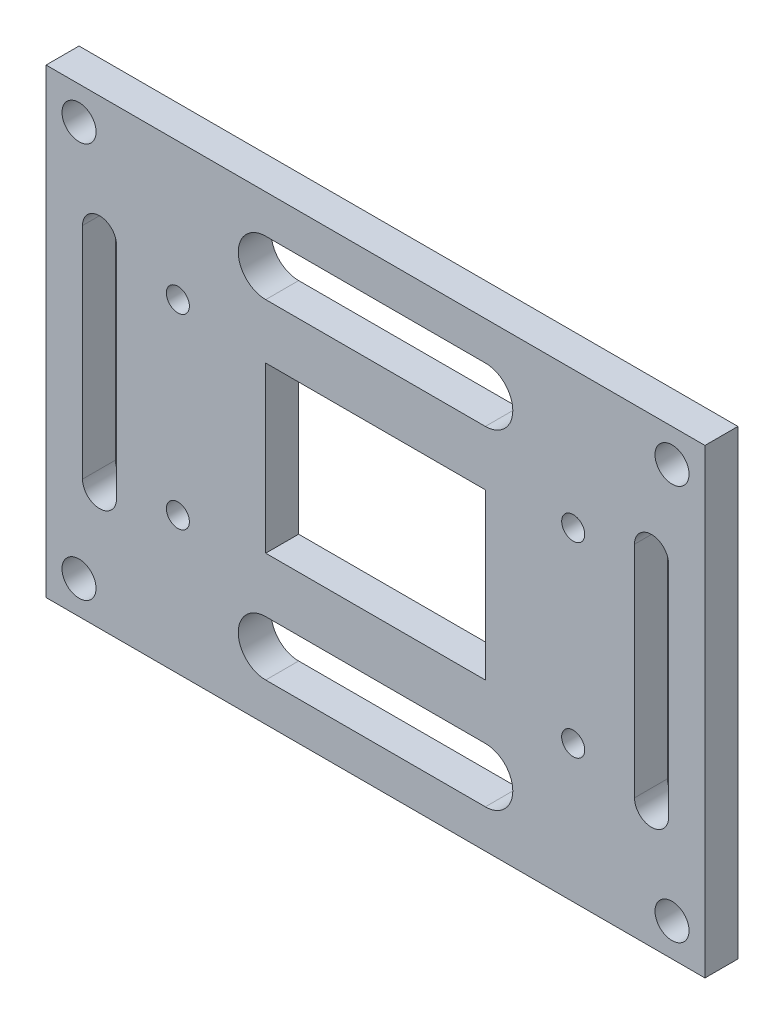
ISO-10303-21;
HEADER;
FILE_DESCRIPTION(('STEP AP214'),'2;1');
FILE_NAME('part.step','',(''),(''),'','','');
FILE_SCHEMA(('AUTOMOTIVE_DESIGN { 1 0 10303 214 1 1 1 1 }'));
ENDSEC;
DATA;
#1=APPLICATION_CONTEXT('core data for automotive mechanical design processes');
#2=APPLICATION_PROTOCOL_DEFINITION('international standard','automotive_design',2000,#1);
#3=PRODUCT_CONTEXT('',#1,'mechanical');
#4=PRODUCT('Part','Part','',(#3));
#5=PRODUCT_RELATED_PRODUCT_CATEGORY('part','',(#4));
#6=PRODUCT_DEFINITION_FORMATION('','',#4);
#7=PRODUCT_DEFINITION_CONTEXT('part definition',#1,'design');
#8=PRODUCT_DEFINITION('design','',#6,#7);
#9=PRODUCT_DEFINITION_SHAPE('','',#8);
#10=(LENGTH_UNIT() NAMED_UNIT(*) SI_UNIT(.MILLI.,.METRE.));
#11=(NAMED_UNIT(*) PLANE_ANGLE_UNIT() SI_UNIT($,.RADIAN.));
#12=(NAMED_UNIT(*) SI_UNIT($,.STERADIAN.) SOLID_ANGLE_UNIT());
#13=UNCERTAINTY_MEASURE_WITH_UNIT(LENGTH_MEASURE(1.E-05),#10,'distance_accuracy_value','');
#14=(GEOMETRIC_REPRESENTATION_CONTEXT(3) GLOBAL_UNCERTAINTY_ASSIGNED_CONTEXT((#13)) GLOBAL_UNIT_ASSIGNED_CONTEXT((#10,
#11,#12)) REPRESENTATION_CONTEXT('',''));
#15=CARTESIAN_POINT('',(0.,0.,0.));
#16=DIRECTION('',(0.,0.,1.));
#17=DIRECTION('',(1.,0.,0.));
#18=AXIS2_PLACEMENT_3D('',#15,#16,#17);
#19=CARTESIAN_POINT('',(0.,0.,3.));
#20=DIRECTION('',(0.,0.,1.));
#21=DIRECTION('',(1.,0.,0.));
#22=AXIS2_PLACEMENT_3D('',#19,#20,#21);
#23=PLANE('',#22);
#24=CARTESIAN_POINT('',(27.,18.,3.));
#25=DIRECTION('',(0.,0.,1.));
#26=DIRECTION('',(1.,0.,0.));
#27=AXIS2_PLACEMENT_3D('',#24,#25,#26);
#28=CIRCLE('',#27,1.55);
#29=CARTESIAN_POINT('',(28.55,18.,3.));
#30=VERTEX_POINT('',#29);
#31=EDGE_CURVE('E333',#30,#30,#28,.T.);
#32=ORIENTED_EDGE('',*,*,#31,.F.);
#33=EDGE_LOOP('',(#32));
#34=FACE_BOUND('',#33,.T.);
#35=CARTESIAN_POINT('',(-27.,-18.,3.));
#36=DIRECTION('',(0.,0.,1.));
#37=DIRECTION('',(1.,0.,0.));
#38=AXIS2_PLACEMENT_3D('',#35,#36,#37);
#39=CIRCLE('',#38,1.55);
#40=CARTESIAN_POINT('',(-25.45,-18.,3.));
#41=VERTEX_POINT('',#40);
#42=EDGE_CURVE('E345',#41,#41,#39,.T.);
#43=ORIENTED_EDGE('',*,*,#42,.F.);
#44=EDGE_LOOP('',(#43));
#45=FACE_BOUND('',#44,.T.);
#46=CARTESIAN_POINT('',(18.,8.5,3.));
#47=DIRECTION('',(0.,0.,1.));
#48=DIRECTION('',(1.,0.,0.));
#49=AXIS2_PLACEMENT_3D('',#46,#47,#48);
#50=CIRCLE('',#49,1.05);
#51=CARTESIAN_POINT('',(19.05,8.5,3.));
#52=VERTEX_POINT('',#51);
#53=EDGE_CURVE('E357',#52,#52,#50,.T.);
#54=ORIENTED_EDGE('',*,*,#53,.F.);
#55=EDGE_LOOP('',(#54));
#56=FACE_BOUND('',#55,.T.);
#57=CARTESIAN_POINT('',(-18.,-8.5,3.));
#58=DIRECTION('',(0.,0.,1.));
#59=DIRECTION('',(1.,0.,0.));
#60=AXIS2_PLACEMENT_3D('',#57,#58,#59);
#61=CIRCLE('',#60,1.05);
#62=CARTESIAN_POINT('',(-16.95,-8.5,3.));
#63=VERTEX_POINT('',#62);
#64=EDGE_CURVE('E369',#63,#63,#61,.T.);
#65=ORIENTED_EDGE('',*,*,#64,.F.);
#66=EDGE_LOOP('',(#65));
#67=FACE_BOUND('',#66,.T.);
#68=DIRECTION('',(0.,1.,0.));
#69=VECTOR('',#68,1.);
#70=CARTESIAN_POINT('',(30.,21.,3.));
#71=LINE('',#70,#69);
#72=CARTESIAN_POINT('',(30.,-21.,3.));
#73=VERTEX_POINT('',#72);
#74=CARTESIAN_POINT('',(30.,21.,3.));
#75=VERTEX_POINT('',#74);
#76=EDGE_CURVE('E406',#73,#75,#71,.T.);
#77=ORIENTED_EDGE('',*,*,#76,.T.);
#78=DIRECTION('',(-1.,0.,0.));
#79=VECTOR('',#78,1.);
#80=CARTESIAN_POINT('',(-30.,21.,3.));
#81=LINE('',#80,#79);
#82=CARTESIAN_POINT('',(-30.,21.,3.));
#83=VERTEX_POINT('',#82);
#84=EDGE_CURVE('E409',#75,#83,#81,.T.);
#85=ORIENTED_EDGE('',*,*,#84,.T.);
#86=DIRECTION('',(0.,-1.,0.));
#87=VECTOR('',#86,1.);
#88=CARTESIAN_POINT('',(-30.,21.,3.));
#89=LINE('',#88,#87);
#90=CARTESIAN_POINT('',(-30.,-21.,3.));
#91=VERTEX_POINT('',#90);
#92=EDGE_CURVE('E412',#83,#91,#89,.T.);
#93=ORIENTED_EDGE('',*,*,#92,.T.);
#94=DIRECTION('',(1.,0.,0.));
#95=VECTOR('',#94,1.);
#96=CARTESIAN_POINT('',(-30.,-21.,3.));
#97=LINE('',#96,#95);
#98=EDGE_CURVE('E414',#91,#73,#97,.T.);
#99=ORIENTED_EDGE('',*,*,#98,.T.);
#100=EDGE_LOOP('',(#77,#85,#93,#99));
#101=FACE_BOUND('',#100,.T.);
#102=DIRECTION('',(-1.,0.,0.));
#103=VECTOR('',#102,1.);
#104=CARTESIAN_POINT('',(-10.,7.5,3.));
#105=LINE('',#104,#103);
#106=CARTESIAN_POINT('',(10.,7.5,3.));
#107=VERTEX_POINT('',#106);
#108=CARTESIAN_POINT('',(-10.,7.5,3.));
#109=VERTEX_POINT('',#108);
#110=EDGE_CURVE('E377',#107,#109,#105,.T.);
#111=ORIENTED_EDGE('',*,*,#110,.F.);
#112=DIRECTION('',(0.,1.,0.));
#113=VECTOR('',#112,1.);
#114=CARTESIAN_POINT('',(10.,7.5,3.));
#115=LINE('',#114,#113);
#116=CARTESIAN_POINT('',(10.,-7.5,3.));
#117=VERTEX_POINT('',#116);
#118=EDGE_CURVE('E375',#117,#107,#115,.T.);
#119=ORIENTED_EDGE('',*,*,#118,.F.);
#120=DIRECTION('',(1.,0.,0.));
#121=VECTOR('',#120,1.);
#122=CARTESIAN_POINT('',(-10.,-7.5,3.));
#123=LINE('',#122,#121);
#124=CARTESIAN_POINT('',(-10.,-7.5,3.));
#125=VERTEX_POINT('',#124);
#126=EDGE_CURVE('E383',#125,#117,#123,.T.);
#127=ORIENTED_EDGE('',*,*,#126,.F.);
#128=DIRECTION('',(0.,-1.,0.));
#129=VECTOR('',#128,1.);
#130=CARTESIAN_POINT('',(-10.,7.5,3.));
#131=LINE('',#130,#129);
#132=EDGE_CURVE('E380',#109,#125,#131,.T.);
#133=ORIENTED_EDGE('',*,*,#132,.F.);
#134=EDGE_LOOP('',(#111,#119,#127,#133));
#135=FACE_BOUND('',#134,.T.);
#136=CARTESIAN_POINT('',(-18.,8.5,3.));
#137=DIRECTION('',(0.,0.,1.));
#138=DIRECTION('',(-1.,0.,0.));
#139=AXIS2_PLACEMENT_3D('',#136,#137,#138);
#140=CIRCLE('',#139,1.05);
#141=CARTESIAN_POINT('',(-19.05,8.5,3.));
#142=VERTEX_POINT('',#141);
#143=EDGE_CURVE('E363',#142,#142,#140,.T.);
#144=ORIENTED_EDGE('',*,*,#143,.F.);
#145=EDGE_LOOP('',(#144));
#146=FACE_BOUND('',#145,.T.);
#147=CARTESIAN_POINT('',(18.,-8.5,3.));
#148=DIRECTION('',(0.,0.,1.));
#149=DIRECTION('',(-1.,0.,0.));
#150=AXIS2_PLACEMENT_3D('',#147,#148,#149);
#151=CIRCLE('',#150,1.05);
#152=CARTESIAN_POINT('',(16.95,-8.5,3.));
#153=VERTEX_POINT('',#152);
#154=EDGE_CURVE('E351',#153,#153,#151,.T.);
#155=ORIENTED_EDGE('',*,*,#154,.F.);
#156=EDGE_LOOP('',(#155));
#157=FACE_BOUND('',#156,.T.);
#158=CARTESIAN_POINT('',(27.,-18.,3.));
#159=DIRECTION('',(0.,0.,1.));
#160=DIRECTION('',(-1.,0.,0.));
#161=AXIS2_PLACEMENT_3D('',#158,#159,#160);
#162=CIRCLE('',#161,1.55);
#163=CARTESIAN_POINT('',(25.45,-18.,3.));
#164=VERTEX_POINT('',#163);
#165=EDGE_CURVE('E339',#164,#164,#162,.T.);
#166=ORIENTED_EDGE('',*,*,#165,.F.);
#167=EDGE_LOOP('',(#166));
#168=FACE_BOUND('',#167,.T.);
#169=CARTESIAN_POINT('',(-27.,18.,3.));
#170=DIRECTION('',(0.,0.,1.));
#171=DIRECTION('',(-1.,0.,0.));
#172=AXIS2_PLACEMENT_3D('',#169,#170,#171);
#173=CIRCLE('',#172,1.55);
#174=CARTESIAN_POINT('',(-28.55,18.,3.));
#175=VERTEX_POINT('',#174);
#176=EDGE_CURVE('E327',#175,#175,#173,.T.);
#177=ORIENTED_EDGE('',*,*,#176,.F.);
#178=EDGE_LOOP('',(#177));
#179=FACE_BOUND('',#178,.T.);
#180=DIRECTION('',(1.,0.,0.));
#181=VECTOR('',#180,1.);
#182=CARTESIAN_POINT('',(-10.,12.5,3.));
#183=LINE('',#182,#181);
#184=CARTESIAN_POINT('',(-10.,12.5,3.));
#185=VERTEX_POINT('',#184);
#186=CARTESIAN_POINT('',(10.,12.5,3.));
#187=VERTEX_POINT('',#186);
#188=EDGE_CURVE('E298',#185,#187,#183,.T.);
#189=ORIENTED_EDGE('',*,*,#188,.F.);
#190=CARTESIAN_POINT('',(-10.,15.,3.));
#191=DIRECTION('',(0.,0.,1.));
#192=DIRECTION('',(1.,0.,0.));
#193=AXIS2_PLACEMENT_3D('',#190,#191,#192);
#194=CIRCLE('',#193,2.5);
#195=CARTESIAN_POINT('',(-10.,17.5,3.));
#196=VERTEX_POINT('',#195);
#197=EDGE_CURVE('E296',#196,#185,#194,.T.);
#198=ORIENTED_EDGE('',*,*,#197,.F.);
#199=DIRECTION('',(-1.,0.,0.));
#200=VECTOR('',#199,1.);
#201=CARTESIAN_POINT('',(-10.,17.5,3.));
#202=LINE('',#201,#200);
#203=CARTESIAN_POINT('',(10.,17.5,3.));
#204=VERTEX_POINT('',#203);
#205=EDGE_CURVE('E304',#204,#196,#202,.T.);
#206=ORIENTED_EDGE('',*,*,#205,.F.);
#207=CARTESIAN_POINT('',(10.,15.,3.));
#208=DIRECTION('',(0.,0.,1.));
#209=DIRECTION('',(1.,0.,0.));
#210=AXIS2_PLACEMENT_3D('',#207,#208,#209);
#211=CIRCLE('',#210,2.5);
#212=EDGE_CURVE('E301',#187,#204,#211,.T.);
#213=ORIENTED_EDGE('',*,*,#212,.F.);
#214=EDGE_LOOP('',(#189,#198,#206,#213));
#215=FACE_BOUND('',#214,.T.);
#216=DIRECTION('',(1.,0.,0.));
#217=VECTOR('',#216,1.);
#218=CARTESIAN_POINT('',(-10.,-17.5,3.));
#219=LINE('',#218,#217);
#220=CARTESIAN_POINT('',(-10.,-17.5,3.));
#221=VERTEX_POINT('',#220);
#222=CARTESIAN_POINT('',(10.,-17.5,3.));
#223=VERTEX_POINT('',#222);
#224=EDGE_CURVE('E267',#221,#223,#219,.T.);
#225=ORIENTED_EDGE('',*,*,#224,.F.);
#226=CARTESIAN_POINT('',(-10.,-15.,3.));
#227=DIRECTION('',(0.,0.,1.));
#228=DIRECTION('',(-1.,0.,0.));
#229=AXIS2_PLACEMENT_3D('',#226,#227,#228);
#230=CIRCLE('',#229,2.5);
#231=CARTESIAN_POINT('',(-10.,-12.5,3.));
#232=VERTEX_POINT('',#231);
#233=EDGE_CURVE('E265',#232,#221,#230,.T.);
#234=ORIENTED_EDGE('',*,*,#233,.F.);
#235=DIRECTION('',(-1.,0.,0.));
#236=VECTOR('',#235,1.);
#237=CARTESIAN_POINT('',(-10.,-12.5,3.));
#238=LINE('',#237,#236);
#239=CARTESIAN_POINT('',(10.,-12.5,3.));
#240=VERTEX_POINT('',#239);
#241=EDGE_CURVE('E273',#240,#232,#238,.T.);
#242=ORIENTED_EDGE('',*,*,#241,.F.);
#243=CARTESIAN_POINT('',(10.,-15.,3.));
#244=DIRECTION('',(0.,0.,1.));
#245=DIRECTION('',(-1.,0.,0.));
#246=AXIS2_PLACEMENT_3D('',#243,#244,#245);
#247=CIRCLE('',#246,2.5);
#248=EDGE_CURVE('E270',#223,#240,#247,.T.);
#249=ORIENTED_EDGE('',*,*,#248,.F.);
#250=EDGE_LOOP('',(#225,#234,#242,#249));
#251=FACE_BOUND('',#250,.T.);
#252=DIRECTION('',(0.,-1.,0.));
#253=VECTOR('',#252,1.);
#254=CARTESIAN_POINT('',(-26.6833255421997,10.,3.));
#255=LINE('',#254,#253);
#256=CARTESIAN_POINT('',(-26.6833255421997,10.,3.));
#257=VERTEX_POINT('',#256);
#258=CARTESIAN_POINT('',(-26.6833255421997,-10.,3.));
#259=VERTEX_POINT('',#258);
#260=EDGE_CURVE('E236',#257,#259,#255,.T.);
#261=ORIENTED_EDGE('',*,*,#260,.F.);
#262=CARTESIAN_POINT('',(-25.1333255421997,10.,3.));
#263=DIRECTION('',(0.,0.,1.));
#264=DIRECTION('',(1.,0.,0.));
#265=AXIS2_PLACEMENT_3D('',#262,#263,#264);
#266=CIRCLE('',#265,1.55);
#267=CARTESIAN_POINT('',(-23.5833255421997,10.,3.));
#268=VERTEX_POINT('',#267);
#269=EDGE_CURVE('E234',#268,#257,#266,.T.);
#270=ORIENTED_EDGE('',*,*,#269,.F.);
#271=DIRECTION('',(0.,1.,0.));
#272=VECTOR('',#271,1.);
#273=CARTESIAN_POINT('',(-23.5833255421997,10.,3.));
#274=LINE('',#273,#272);
#275=CARTESIAN_POINT('',(-23.5833255421997,-10.,3.));
#276=VERTEX_POINT('',#275);
#277=EDGE_CURVE('E242',#276,#268,#274,.T.);
#278=ORIENTED_EDGE('',*,*,#277,.F.);
#279=CARTESIAN_POINT('',(-25.1333255421997,-10.,3.));
#280=DIRECTION('',(0.,0.,1.));
#281=DIRECTION('',(1.,0.,0.));
#282=AXIS2_PLACEMENT_3D('',#279,#280,#281);
#283=CIRCLE('',#282,1.55);
#284=EDGE_CURVE('E239',#259,#276,#283,.T.);
#285=ORIENTED_EDGE('',*,*,#284,.F.);
#286=EDGE_LOOP('',(#261,#270,#278,#285));
#287=FACE_BOUND('',#286,.T.);
#288=DIRECTION('',(0.,-1.,0.));
#289=VECTOR('',#288,1.);
#290=CARTESIAN_POINT('',(23.5833255421997,10.,3.));
#291=LINE('',#290,#289);
#292=CARTESIAN_POINT('',(23.5833255421997,10.,3.));
#293=VERTEX_POINT('',#292);
#294=CARTESIAN_POINT('',(23.5833255421997,-10.,3.));
#295=VERTEX_POINT('',#294);
#296=EDGE_CURVE('E206',#293,#295,#291,.T.);
#297=ORIENTED_EDGE('',*,*,#296,.F.);
#298=CARTESIAN_POINT('',(25.1333255421997,10.,3.));
#299=DIRECTION('',(0.,0.,1.));
#300=DIRECTION('',(-1.,0.,0.));
#301=AXIS2_PLACEMENT_3D('',#298,#299,#300);
#302=CIRCLE('',#301,1.55);
#303=CARTESIAN_POINT('',(26.6833255421997,10.,3.));
#304=VERTEX_POINT('',#303);
#305=EDGE_CURVE('E198',#304,#293,#302,.T.);
#306=ORIENTED_EDGE('',*,*,#305,.F.);
#307=DIRECTION('',(0.,1.,0.));
#308=VECTOR('',#307,1.);
#309=CARTESIAN_POINT('',(26.6833255421997,10.,3.));
#310=LINE('',#309,#308);
#311=CARTESIAN_POINT('',(26.6833255421997,-10.,3.));
#312=VERTEX_POINT('',#311);
#313=EDGE_CURVE('E220',#312,#304,#310,.T.);
#314=ORIENTED_EDGE('',*,*,#313,.F.);
#315=CARTESIAN_POINT('',(25.1333255421997,-10.,3.));
#316=DIRECTION('',(0.,0.,1.));
#317=DIRECTION('',(-1.,0.,0.));
#318=AXIS2_PLACEMENT_3D('',#315,#316,#317);
#319=CIRCLE('',#318,1.55);
#320=EDGE_CURVE('E218',#295,#312,#319,.T.);
#321=ORIENTED_EDGE('',*,*,#320,.F.);
#322=EDGE_LOOP('',(#297,#306,#314,#321));
#323=FACE_BOUND('',#322,.T.);
#324=ADVANCED_FACE('F37',(#34,#45,#56,#67,#101,#135,#146,#157,#168,#179,#215,#251,#287,#323),
#23,.T.);
#325=CARTESIAN_POINT('',(0.,0.,0.));
#326=DIRECTION('',(0.,0.,1.));
#327=DIRECTION('',(1.,0.,0.));
#328=AXIS2_PLACEMENT_3D('',#325,#326,#327);
#329=PLANE('',#328);
#330=CARTESIAN_POINT('',(-25.1333255421997,10.,0.));
#331=DIRECTION('',(0.,0.,1.));
#332=DIRECTION('',(1.,0.,0.));
#333=AXIS2_PLACEMENT_3D('',#330,#331,#332);
#334=CIRCLE('',#333,1.55);
#335=CARTESIAN_POINT('',(-23.5833255421997,10.,0.));
#336=VERTEX_POINT('',#335);
#337=CARTESIAN_POINT('',(-26.6833255421997,10.,0.));
#338=VERTEX_POINT('',#337);
#339=EDGE_CURVE('E214',#336,#338,#334,.T.);
#340=ORIENTED_EDGE('',*,*,#339,.T.);
#341=DIRECTION('',(0.,-1.,0.));
#342=VECTOR('',#341,1.);
#343=CARTESIAN_POINT('',(-26.6833255421997,10.,0.));
#344=LINE('',#343,#342);
#345=CARTESIAN_POINT('',(-26.6833255421997,-10.,0.));
#346=VERTEX_POINT('',#345);
#347=EDGE_CURVE('E247',#338,#346,#344,.T.);
#348=ORIENTED_EDGE('',*,*,#347,.T.);
#349=CARTESIAN_POINT('',(-25.1333255421997,-10.,0.));
#350=DIRECTION('',(0.,0.,1.));
#351=DIRECTION('',(1.,0.,0.));
#352=AXIS2_PLACEMENT_3D('',#349,#350,#351);
#353=CIRCLE('',#352,1.55);
#354=CARTESIAN_POINT('',(-23.5833255421997,-10.,0.));
#355=VERTEX_POINT('',#354);
#356=EDGE_CURVE('E250',#346,#355,#353,.T.);
#357=ORIENTED_EDGE('',*,*,#356,.T.);
#358=DIRECTION('',(0.,1.,0.));
#359=VECTOR('',#358,1.);
#360=CARTESIAN_POINT('',(-23.5833255421997,10.,0.));
#361=LINE('',#360,#359);
#362=EDGE_CURVE('E237',#355,#336,#361,.T.);
#363=ORIENTED_EDGE('',*,*,#362,.T.);
#364=EDGE_LOOP('',(#340,#348,#357,#363));
#365=FACE_BOUND('',#364,.T.);
#366=CARTESIAN_POINT('',(-10.,15.,0.));
#367=DIRECTION('',(0.,0.,1.));
#368=DIRECTION('',(1.,0.,0.));
#369=AXIS2_PLACEMENT_3D('',#366,#367,#368);
#370=CIRCLE('',#369,2.5);
#371=CARTESIAN_POINT('',(-10.,17.5,0.));
#372=VERTEX_POINT('',#371);
#373=CARTESIAN_POINT('',(-10.,12.5,0.));
#374=VERTEX_POINT('',#373);
#375=EDGE_CURVE('E295',#372,#374,#370,.T.);
#376=ORIENTED_EDGE('',*,*,#375,.T.);
#377=DIRECTION('',(1.,0.,0.));
#378=VECTOR('',#377,1.);
#379=CARTESIAN_POINT('',(-10.,12.5,0.));
#380=LINE('',#379,#378);
#381=CARTESIAN_POINT('',(10.,12.5,0.));
#382=VERTEX_POINT('',#381);
#383=EDGE_CURVE('E309',#374,#382,#380,.T.);
#384=ORIENTED_EDGE('',*,*,#383,.T.);
#385=CARTESIAN_POINT('',(10.,15.,0.));
#386=DIRECTION('',(0.,0.,1.));
#387=DIRECTION('',(1.,0.,0.));
#388=AXIS2_PLACEMENT_3D('',#385,#386,#387);
#389=CIRCLE('',#388,2.5);
#390=CARTESIAN_POINT('',(10.,17.5,0.));
#391=VERTEX_POINT('',#390);
#392=EDGE_CURVE('E312',#382,#391,#389,.T.);
#393=ORIENTED_EDGE('',*,*,#392,.T.);
#394=DIRECTION('',(-1.,0.,0.));
#395=VECTOR('',#394,1.);
#396=CARTESIAN_POINT('',(-10.,17.5,0.));
#397=LINE('',#396,#395);
#398=EDGE_CURVE('E299',#391,#372,#397,.T.);
#399=ORIENTED_EDGE('',*,*,#398,.T.);
#400=EDGE_LOOP('',(#376,#384,#393,#399));
#401=FACE_BOUND('',#400,.T.);
#402=DIRECTION('',(0.,1.,0.));
#403=VECTOR('',#402,1.);
#404=CARTESIAN_POINT('',(30.,21.,0.));
#405=LINE('',#404,#403);
#406=CARTESIAN_POINT('',(30.,-21.,0.));
#407=VERTEX_POINT('',#406);
#408=CARTESIAN_POINT('',(30.,21.,0.));
#409=VERTEX_POINT('',#408);
#410=EDGE_CURVE('E405',#407,#409,#405,.T.);
#411=ORIENTED_EDGE('',*,*,#410,.F.);
#412=DIRECTION('',(1.,0.,0.));
#413=VECTOR('',#412,1.);
#414=CARTESIAN_POINT('',(-30.,-21.,0.));
#415=LINE('',#414,#413);
#416=CARTESIAN_POINT('',(-30.,-21.,0.));
#417=VERTEX_POINT('',#416);
#418=EDGE_CURVE('E410',#417,#407,#415,.T.);
#419=ORIENTED_EDGE('',*,*,#418,.F.);
#420=DIRECTION('',(0.,-1.,0.));
#421=VECTOR('',#420,1.);
#422=CARTESIAN_POINT('',(-30.,21.,0.));
#423=LINE('',#422,#421);
#424=CARTESIAN_POINT('',(-30.,21.,0.));
#425=VERTEX_POINT('',#424);
#426=EDGE_CURVE('E421',#425,#417,#423,.T.);
#427=ORIENTED_EDGE('',*,*,#426,.F.);
#428=DIRECTION('',(-1.,0.,0.));
#429=VECTOR('',#428,1.);
#430=CARTESIAN_POINT('',(-30.,21.,0.));
#431=LINE('',#430,#429);
#432=EDGE_CURVE('E419',#409,#425,#431,.T.);
#433=ORIENTED_EDGE('',*,*,#432,.F.);
#434=EDGE_LOOP('',(#411,#419,#427,#433));
#435=FACE_BOUND('',#434,.T.);
#436=DIRECTION('',(0.,1.,0.));
#437=VECTOR('',#436,1.);
#438=CARTESIAN_POINT('',(10.,7.5,0.));
#439=LINE('',#438,#437);
#440=CARTESIAN_POINT('',(10.,-7.5,0.));
#441=VERTEX_POINT('',#440);
#442=CARTESIAN_POINT('',(10.,7.5,0.));
#443=VERTEX_POINT('',#442);
#444=EDGE_CURVE('E372',#441,#443,#439,.T.);
#445=ORIENTED_EDGE('',*,*,#444,.T.);
#446=DIRECTION('',(-1.,0.,0.));
#447=VECTOR('',#446,1.);
#448=CARTESIAN_POINT('',(-10.,7.5,0.));
#449=LINE('',#448,#447);
#450=CARTESIAN_POINT('',(-10.,7.5,0.));
#451=VERTEX_POINT('',#450);
#452=EDGE_CURVE('E388',#443,#451,#449,.T.);
#453=ORIENTED_EDGE('',*,*,#452,.T.);
#454=DIRECTION('',(0.,-1.,0.));
#455=VECTOR('',#454,1.);
#456=CARTESIAN_POINT('',(-10.,7.5,0.));
#457=LINE('',#456,#455);
#458=CARTESIAN_POINT('',(-10.,-7.5,0.));
#459=VERTEX_POINT('',#458);
#460=EDGE_CURVE('E391',#451,#459,#457,.T.);
#461=ORIENTED_EDGE('',*,*,#460,.T.);
#462=DIRECTION('',(1.,0.,0.));
#463=VECTOR('',#462,1.);
#464=CARTESIAN_POINT('',(-10.,-7.5,0.));
#465=LINE('',#464,#463);
#466=EDGE_CURVE('E378',#459,#441,#465,.T.);
#467=ORIENTED_EDGE('',*,*,#466,.T.);
#468=EDGE_LOOP('',(#445,#453,#461,#467));
#469=FACE_BOUND('',#468,.T.);
#470=CARTESIAN_POINT('',(-18.,-8.5,0.));
#471=DIRECTION('',(0.,0.,1.));
#472=DIRECTION('',(1.,0.,0.));
#473=AXIS2_PLACEMENT_3D('',#470,#471,#472);
#474=CIRCLE('',#473,1.05);
#475=CARTESIAN_POINT('',(-16.95,-8.5,0.));
#476=VERTEX_POINT('',#475);
#477=EDGE_CURVE('E366',#476,#476,#474,.T.);
#478=ORIENTED_EDGE('',*,*,#477,.T.);
#479=EDGE_LOOP('',(#478));
#480=FACE_BOUND('',#479,.T.);
#481=CARTESIAN_POINT('',(-18.,8.5,0.));
#482=DIRECTION('',(0.,0.,1.));
#483=DIRECTION('',(-1.,0.,0.));
#484=AXIS2_PLACEMENT_3D('',#481,#482,#483);
#485=CIRCLE('',#484,1.05);
#486=CARTESIAN_POINT('',(-19.05,8.5,0.));
#487=VERTEX_POINT('',#486);
#488=EDGE_CURVE('E360',#487,#487,#485,.T.);
#489=ORIENTED_EDGE('',*,*,#488,.T.);
#490=EDGE_LOOP('',(#489));
#491=FACE_BOUND('',#490,.T.);
#492=CARTESIAN_POINT('',(18.,8.5,0.));
#493=DIRECTION('',(0.,0.,1.));
#494=DIRECTION('',(1.,0.,0.));
#495=AXIS2_PLACEMENT_3D('',#492,#493,#494);
#496=CIRCLE('',#495,1.05);
#497=CARTESIAN_POINT('',(19.05,8.5,0.));
#498=VERTEX_POINT('',#497);
#499=EDGE_CURVE('E354',#498,#498,#496,.T.);
#500=ORIENTED_EDGE('',*,*,#499,.T.);
#501=EDGE_LOOP('',(#500));
#502=FACE_BOUND('',#501,.T.);
#503=CARTESIAN_POINT('',(18.,-8.5,0.));
#504=DIRECTION('',(0.,0.,1.));
#505=DIRECTION('',(-1.,0.,0.));
#506=AXIS2_PLACEMENT_3D('',#503,#504,#505);
#507=CIRCLE('',#506,1.05);
#508=CARTESIAN_POINT('',(16.95,-8.5,0.));
#509=VERTEX_POINT('',#508);
#510=EDGE_CURVE('E348',#509,#509,#507,.T.);
#511=ORIENTED_EDGE('',*,*,#510,.T.);
#512=EDGE_LOOP('',(#511));
#513=FACE_BOUND('',#512,.T.);
#514=CARTESIAN_POINT('',(-27.,-18.,0.));
#515=DIRECTION('',(0.,0.,1.));
#516=DIRECTION('',(1.,0.,0.));
#517=AXIS2_PLACEMENT_3D('',#514,#515,#516);
#518=CIRCLE('',#517,1.55);
#519=CARTESIAN_POINT('',(-25.45,-18.,0.));
#520=VERTEX_POINT('',#519);
#521=EDGE_CURVE('E342',#520,#520,#518,.T.);
#522=ORIENTED_EDGE('',*,*,#521,.T.);
#523=EDGE_LOOP('',(#522));
#524=FACE_BOUND('',#523,.T.);
#525=CARTESIAN_POINT('',(27.,-18.,0.));
#526=DIRECTION('',(0.,0.,1.));
#527=DIRECTION('',(-1.,0.,0.));
#528=AXIS2_PLACEMENT_3D('',#525,#526,#527);
#529=CIRCLE('',#528,1.55);
#530=CARTESIAN_POINT('',(25.45,-18.,0.));
#531=VERTEX_POINT('',#530);
#532=EDGE_CURVE('E336',#531,#531,#529,.T.);
#533=ORIENTED_EDGE('',*,*,#532,.T.);
#534=EDGE_LOOP('',(#533));
#535=FACE_BOUND('',#534,.T.);
#536=CARTESIAN_POINT('',(27.,18.,0.));
#537=DIRECTION('',(0.,0.,1.));
#538=DIRECTION('',(1.,0.,0.));
#539=AXIS2_PLACEMENT_3D('',#536,#537,#538);
#540=CIRCLE('',#539,1.55);
#541=CARTESIAN_POINT('',(28.55,18.,0.));
#542=VERTEX_POINT('',#541);
#543=EDGE_CURVE('E330',#542,#542,#540,.T.);
#544=ORIENTED_EDGE('',*,*,#543,.T.);
#545=EDGE_LOOP('',(#544));
#546=FACE_BOUND('',#545,.T.);
#547=CARTESIAN_POINT('',(-27.,18.,0.));
#548=DIRECTION('',(0.,0.,1.));
#549=DIRECTION('',(-1.,0.,0.));
#550=AXIS2_PLACEMENT_3D('',#547,#548,#549);
#551=CIRCLE('',#550,1.55);
#552=CARTESIAN_POINT('',(-28.55,18.,0.));
#553=VERTEX_POINT('',#552);
#554=EDGE_CURVE('E326',#553,#553,#551,.T.);
#555=ORIENTED_EDGE('',*,*,#554,.T.);
#556=EDGE_LOOP('',(#555));
#557=FACE_BOUND('',#556,.T.);
#558=CARTESIAN_POINT('',(-10.,-15.,0.));
#559=DIRECTION('',(0.,0.,1.));
#560=DIRECTION('',(-1.,0.,0.));
#561=AXIS2_PLACEMENT_3D('',#558,#559,#560);
#562=CIRCLE('',#561,2.5);
#563=CARTESIAN_POINT('',(-10.,-12.5,0.));
#564=VERTEX_POINT('',#563);
#565=CARTESIAN_POINT('',(-10.,-17.5,0.));
#566=VERTEX_POINT('',#565);
#567=EDGE_CURVE('E264',#564,#566,#562,.T.);
#568=ORIENTED_EDGE('',*,*,#567,.T.);
#569=DIRECTION('',(1.,0.,0.));
#570=VECTOR('',#569,1.);
#571=CARTESIAN_POINT('',(-10.,-17.5,0.));
#572=LINE('',#571,#570);
#573=CARTESIAN_POINT('',(10.,-17.5,0.));
#574=VERTEX_POINT('',#573);
#575=EDGE_CURVE('E278',#566,#574,#572,.T.);
#576=ORIENTED_EDGE('',*,*,#575,.T.);
#577=CARTESIAN_POINT('',(10.,-15.,0.));
#578=DIRECTION('',(0.,0.,1.));
#579=DIRECTION('',(-1.,0.,0.));
#580=AXIS2_PLACEMENT_3D('',#577,#578,#579);
#581=CIRCLE('',#580,2.5);
#582=CARTESIAN_POINT('',(10.,-12.5,0.));
#583=VERTEX_POINT('',#582);
#584=EDGE_CURVE('E281',#574,#583,#581,.T.);
#585=ORIENTED_EDGE('',*,*,#584,.T.);
#586=DIRECTION('',(-1.,0.,0.));
#587=VECTOR('',#586,1.);
#588=CARTESIAN_POINT('',(-10.,-12.5,0.));
#589=LINE('',#588,#587);
#590=EDGE_CURVE('E268',#583,#564,#589,.T.);
#591=ORIENTED_EDGE('',*,*,#590,.T.);
#592=EDGE_LOOP('',(#568,#576,#585,#591));
#593=FACE_BOUND('',#592,.T.);
#594=CARTESIAN_POINT('',(25.1333255421997,10.,0.));
#595=DIRECTION('',(0.,0.,1.));
#596=DIRECTION('',(-1.,0.,0.));
#597=AXIS2_PLACEMENT_3D('',#594,#595,#596);
#598=CIRCLE('',#597,1.55);
#599=CARTESIAN_POINT('',(26.6833255421997,10.,0.));
#600=VERTEX_POINT('',#599);
#601=CARTESIAN_POINT('',(23.5833255421997,10.,0.));
#602=VERTEX_POINT('',#601);
#603=EDGE_CURVE('E60',#600,#602,#598,.T.);
#604=ORIENTED_EDGE('',*,*,#603,.T.);
#605=DIRECTION('',(0.,-1.,0.));
#606=VECTOR('',#605,1.);
#607=CARTESIAN_POINT('',(23.5833255421997,10.,0.));
#608=LINE('',#607,#606);
#609=CARTESIAN_POINT('',(23.5833255421997,-10.,0.));
#610=VERTEX_POINT('',#609);
#611=EDGE_CURVE('E213',#602,#610,#608,.T.);
#612=ORIENTED_EDGE('',*,*,#611,.T.);
#613=CARTESIAN_POINT('',(25.1333255421997,-10.,0.));
#614=DIRECTION('',(0.,0.,1.));
#615=DIRECTION('',(-1.,0.,0.));
#616=AXIS2_PLACEMENT_3D('',#613,#614,#615);
#617=CIRCLE('',#616,1.55);
#618=CARTESIAN_POINT('',(26.6833255421997,-10.,0.));
#619=VERTEX_POINT('',#618);
#620=EDGE_CURVE('E226',#610,#619,#617,.T.);
#621=ORIENTED_EDGE('',*,*,#620,.T.);
#622=DIRECTION('',(0.,1.,0.));
#623=VECTOR('',#622,1.);
#624=CARTESIAN_POINT('',(26.6833255421997,10.,0.));
#625=LINE('',#624,#623);
#626=EDGE_CURVE('E207',#619,#600,#625,.T.);
#627=ORIENTED_EDGE('',*,*,#626,.T.);
#628=EDGE_LOOP('',(#604,#612,#621,#627));
#629=FACE_BOUND('',#628,.T.);
#630=ADVANCED_FACE('F439',(#365,#401,#435,#469,#480,#491,#502,#513,#524,#535,#546,#557,#593,
#629),#329,.F.);
#631=CARTESIAN_POINT('',(30.,21.,3.));
#632=DIRECTION('',(-1.,0.,0.));
#633=DIRECTION('',(0.,-1.,0.));
#634=AXIS2_PLACEMENT_3D('',#631,#632,#633);
#635=PLANE('',#634);
#636=ORIENTED_EDGE('',*,*,#410,.T.);
#637=DIRECTION('',(0.,0.,-1.));
#638=VECTOR('',#637,1.);
#639=CARTESIAN_POINT('',(30.,21.,3.));
#640=LINE('',#639,#638);
#641=EDGE_CURVE('E11',#75,#409,#640,.T.);
#642=ORIENTED_EDGE('',*,*,#641,.F.);
#643=ORIENTED_EDGE('',*,*,#76,.F.);
#644=DIRECTION('',(0.,0.,-1.));
#645=VECTOR('',#644,1.);
#646=CARTESIAN_POINT('',(30.,-21.,3.));
#647=LINE('',#646,#645);
#648=EDGE_CURVE('E416',#73,#407,#647,.T.);
#649=ORIENTED_EDGE('',*,*,#648,.T.);
#650=EDGE_LOOP('',(#636,#642,#643,#649));
#651=FACE_BOUND('',#650,.T.);
#652=ADVANCED_FACE('F39',(#651),#635,.F.);
#653=CARTESIAN_POINT('',(-30.,21.,3.));
#654=DIRECTION('',(0.,-1.,0.));
#655=DIRECTION('',(0.,0.,-1.));
#656=AXIS2_PLACEMENT_3D('',#653,#654,#655);
#657=PLANE('',#656);
#658=ORIENTED_EDGE('',*,*,#432,.T.);
#659=DIRECTION('',(0.,0.,-1.));
#660=VECTOR('',#659,1.);
#661=CARTESIAN_POINT('',(-30.,21.,3.));
#662=LINE('',#661,#660);
#663=EDGE_CURVE('E45',#83,#425,#662,.T.);
#664=ORIENTED_EDGE('',*,*,#663,.F.);
#665=ORIENTED_EDGE('',*,*,#84,.F.);
#666=ORIENTED_EDGE('',*,*,#641,.T.);
#667=EDGE_LOOP('',(#658,#664,#665,#666));
#668=FACE_BOUND('',#667,.T.);
#669=ADVANCED_FACE('F450',(#668),#657,.F.);
#670=CARTESIAN_POINT('',(-30.,21.,3.));
#671=DIRECTION('',(1.,0.,0.));
#672=DIRECTION('',(0.,1.,0.));
#673=AXIS2_PLACEMENT_3D('',#670,#671,#672);
#674=PLANE('',#673);
#675=ORIENTED_EDGE('',*,*,#426,.T.);
#676=DIRECTION('',(0.,0.,-1.));
#677=VECTOR('',#676,1.);
#678=CARTESIAN_POINT('',(-30.,-21.,3.));
#679=LINE('',#678,#677);
#680=EDGE_CURVE('E426',#91,#417,#679,.T.);
#681=ORIENTED_EDGE('',*,*,#680,.F.);
#682=ORIENTED_EDGE('',*,*,#92,.F.);
#683=ORIENTED_EDGE('',*,*,#663,.T.);
#684=EDGE_LOOP('',(#675,#681,#682,#683));
#685=FACE_BOUND('',#684,.T.);
#686=ADVANCED_FACE('F433',(#685),#674,.F.);
#687=CARTESIAN_POINT('',(-30.,-21.,3.));
#688=DIRECTION('',(0.,1.,0.));
#689=DIRECTION('',(0.,0.,1.));
#690=AXIS2_PLACEMENT_3D('',#687,#688,#689);
#691=PLANE('',#690);
#692=ORIENTED_EDGE('',*,*,#418,.T.);
#693=ORIENTED_EDGE('',*,*,#648,.F.);
#694=ORIENTED_EDGE('',*,*,#98,.F.);
#695=ORIENTED_EDGE('',*,*,#680,.T.);
#696=EDGE_LOOP('',(#692,#693,#694,#695));
#697=FACE_BOUND('',#696,.T.);
#698=ADVANCED_FACE('F443',(#697),#691,.F.);
#699=CARTESIAN_POINT('',(10.,7.5,3.));
#700=DIRECTION('',(-1.,0.,0.));
#701=DIRECTION('',(0.,0.,1.));
#702=AXIS2_PLACEMENT_3D('',#699,#700,#701);
#703=PLANE('',#702);
#704=ORIENTED_EDGE('',*,*,#444,.F.);
#705=DIRECTION('',(0.,0.,-1.));
#706=VECTOR('',#705,1.);
#707=CARTESIAN_POINT('',(10.,-7.5,3.));
#708=LINE('',#707,#706);
#709=EDGE_CURVE('E385',#117,#441,#708,.T.);
#710=ORIENTED_EDGE('',*,*,#709,.F.);
#711=ORIENTED_EDGE('',*,*,#118,.T.);
#712=DIRECTION('',(0.,0.,-1.));
#713=VECTOR('',#712,1.);
#714=CARTESIAN_POINT('',(10.,7.5,3.));
#715=LINE('',#714,#713);
#716=EDGE_CURVE('E402',#107,#443,#715,.T.);
#717=ORIENTED_EDGE('',*,*,#716,.T.);
#718=EDGE_LOOP('',(#704,#710,#711,#717));
#719=FACE_BOUND('',#718,.T.);
#720=ADVANCED_FACE('F468',(#719),#703,.T.);
#721=CARTESIAN_POINT('',(-10.,7.5,3.));
#722=DIRECTION('',(0.,-1.,0.));
#723=DIRECTION('',(1.,0.,0.));
#724=AXIS2_PLACEMENT_3D('',#721,#722,#723);
#725=PLANE('',#724);
#726=ORIENTED_EDGE('',*,*,#452,.F.);
#727=ORIENTED_EDGE('',*,*,#716,.F.);
#728=ORIENTED_EDGE('',*,*,#110,.T.);
#729=DIRECTION('',(0.,0.,-1.));
#730=VECTOR('',#729,1.);
#731=CARTESIAN_POINT('',(-10.,7.5,3.));
#732=LINE('',#731,#730);
#733=EDGE_CURVE('E400',#109,#451,#732,.T.);
#734=ORIENTED_EDGE('',*,*,#733,.T.);
#735=EDGE_LOOP('',(#726,#727,#728,#734));
#736=FACE_BOUND('',#735,.T.);
#737=ADVANCED_FACE('F475',(#736),#725,.T.);
#738=CARTESIAN_POINT('',(-10.,7.5,3.));
#739=DIRECTION('',(1.,0.,0.));
#740=DIRECTION('',(0.,1.,0.));
#741=AXIS2_PLACEMENT_3D('',#738,#739,#740);
#742=PLANE('',#741);
#743=ORIENTED_EDGE('',*,*,#460,.F.);
#744=ORIENTED_EDGE('',*,*,#733,.F.);
#745=ORIENTED_EDGE('',*,*,#132,.T.);
#746=DIRECTION('',(0.,0.,-1.));
#747=VECTOR('',#746,1.);
#748=CARTESIAN_POINT('',(-10.,-7.5,3.));
#749=LINE('',#748,#747);
#750=EDGE_CURVE('E398',#125,#459,#749,.T.);
#751=ORIENTED_EDGE('',*,*,#750,.T.);
#752=EDGE_LOOP('',(#743,#744,#745,#751));
#753=FACE_BOUND('',#752,.T.);
#754=ADVANCED_FACE('F480',(#753),#742,.T.);
#755=CARTESIAN_POINT('',(-10.,-7.5,3.));
#756=DIRECTION('',(0.,1.,0.));
#757=DIRECTION('',(0.,0.,1.));
#758=AXIS2_PLACEMENT_3D('',#755,#756,#757);
#759=PLANE('',#758);
#760=ORIENTED_EDGE('',*,*,#466,.F.);
#761=ORIENTED_EDGE('',*,*,#750,.F.);
#762=ORIENTED_EDGE('',*,*,#126,.T.);
#763=ORIENTED_EDGE('',*,*,#709,.T.);
#764=EDGE_LOOP('',(#760,#761,#762,#763));
#765=FACE_BOUND('',#764,.T.);
#766=ADVANCED_FACE('F487',(#765),#759,.T.);
#767=CARTESIAN_POINT('',(-18.,-8.5,3.));
#768=DIRECTION('',(0.,0.,-1.));
#769=DIRECTION('',(-1.,0.,0.));
#770=AXIS2_PLACEMENT_3D('',#767,#768,#769);
#771=CYLINDRICAL_SURFACE('',#770,1.05);
#772=ORIENTED_EDGE('',*,*,#64,.T.);
#773=EDGE_LOOP('',(#772));
#774=FACE_BOUND('',#773,.T.);
#775=ORIENTED_EDGE('',*,*,#477,.F.);
#776=EDGE_LOOP('',(#775));
#777=FACE_BOUND('',#776,.T.);
#778=ADVANCED_FACE('F603',(#774,#777),#771,.F.);
#779=CARTESIAN_POINT('',(-18.,8.5,3.));
#780=DIRECTION('',(0.,0.,-1.));
#781=DIRECTION('',(-1.,0.,0.));
#782=AXIS2_PLACEMENT_3D('',#779,#780,#781);
#783=CYLINDRICAL_SURFACE('',#782,1.05);
#784=ORIENTED_EDGE('',*,*,#143,.T.);
#785=EDGE_LOOP('',(#784));
#786=FACE_BOUND('',#785,.T.);
#787=ORIENTED_EDGE('',*,*,#488,.F.);
#788=EDGE_LOOP('',(#787));
#789=FACE_BOUND('',#788,.T.);
#790=ADVANCED_FACE('F599',(#786,#789),#783,.F.);
#791=CARTESIAN_POINT('',(18.,8.5,3.));
#792=DIRECTION('',(0.,0.,-1.));
#793=DIRECTION('',(-1.,0.,0.));
#794=AXIS2_PLACEMENT_3D('',#791,#792,#793);
#795=CYLINDRICAL_SURFACE('',#794,1.05);
#796=ORIENTED_EDGE('',*,*,#53,.T.);
#797=EDGE_LOOP('',(#796));
#798=FACE_BOUND('',#797,.T.);
#799=ORIENTED_EDGE('',*,*,#499,.F.);
#800=EDGE_LOOP('',(#799));
#801=FACE_BOUND('',#800,.T.);
#802=ADVANCED_FACE('F595',(#798,#801),#795,.F.);
#803=CARTESIAN_POINT('',(18.,-8.5,3.));
#804=DIRECTION('',(0.,0.,-1.));
#805=DIRECTION('',(-1.,0.,0.));
#806=AXIS2_PLACEMENT_3D('',#803,#804,#805);
#807=CYLINDRICAL_SURFACE('',#806,1.05);
#808=ORIENTED_EDGE('',*,*,#154,.T.);
#809=EDGE_LOOP('',(#808));
#810=FACE_BOUND('',#809,.T.);
#811=ORIENTED_EDGE('',*,*,#510,.F.);
#812=EDGE_LOOP('',(#811));
#813=FACE_BOUND('',#812,.T.);
#814=ADVANCED_FACE('F591',(#810,#813),#807,.F.);
#815=CARTESIAN_POINT('',(-27.,-18.,3.));
#816=DIRECTION('',(0.,0.,-1.));
#817=DIRECTION('',(-1.,0.,0.));
#818=AXIS2_PLACEMENT_3D('',#815,#816,#817);
#819=CYLINDRICAL_SURFACE('',#818,1.55);
#820=ORIENTED_EDGE('',*,*,#42,.T.);
#821=EDGE_LOOP('',(#820));
#822=FACE_BOUND('',#821,.T.);
#823=ORIENTED_EDGE('',*,*,#521,.F.);
#824=EDGE_LOOP('',(#823));
#825=FACE_BOUND('',#824,.T.);
#826=ADVANCED_FACE('F587',(#822,#825),#819,.F.);
#827=CARTESIAN_POINT('',(27.,-18.,3.));
#828=DIRECTION('',(0.,0.,-1.));
#829=DIRECTION('',(-1.,0.,0.));
#830=AXIS2_PLACEMENT_3D('',#827,#828,#829);
#831=CYLINDRICAL_SURFACE('',#830,1.55);
#832=ORIENTED_EDGE('',*,*,#165,.T.);
#833=EDGE_LOOP('',(#832));
#834=FACE_BOUND('',#833,.T.);
#835=ORIENTED_EDGE('',*,*,#532,.F.);
#836=EDGE_LOOP('',(#835));
#837=FACE_BOUND('',#836,.T.);
#838=ADVANCED_FACE('F583',(#834,#837),#831,.F.);
#839=CARTESIAN_POINT('',(27.,18.,3.));
#840=DIRECTION('',(0.,0.,-1.));
#841=DIRECTION('',(-1.,0.,0.));
#842=AXIS2_PLACEMENT_3D('',#839,#840,#841);
#843=CYLINDRICAL_SURFACE('',#842,1.55);
#844=ORIENTED_EDGE('',*,*,#31,.T.);
#845=EDGE_LOOP('',(#844));
#846=FACE_BOUND('',#845,.T.);
#847=ORIENTED_EDGE('',*,*,#543,.F.);
#848=EDGE_LOOP('',(#847));
#849=FACE_BOUND('',#848,.T.);
#850=ADVANCED_FACE('F579',(#846,#849),#843,.F.);
#851=CARTESIAN_POINT('',(-27.,18.,3.));
#852=DIRECTION('',(0.,0.,-1.));
#853=DIRECTION('',(-1.,0.,0.));
#854=AXIS2_PLACEMENT_3D('',#851,#852,#853);
#855=CYLINDRICAL_SURFACE('',#854,1.55);
#856=ORIENTED_EDGE('',*,*,#176,.T.);
#857=EDGE_LOOP('',(#856));
#858=FACE_BOUND('',#857,.T.);
#859=ORIENTED_EDGE('',*,*,#554,.F.);
#860=EDGE_LOOP('',(#859));
#861=FACE_BOUND('',#860,.T.);
#862=ADVANCED_FACE('F575',(#858,#861),#855,.F.);
#863=CARTESIAN_POINT('',(-10.,15.,3.));
#864=DIRECTION('',(0.,0.,-1.));
#865=DIRECTION('',(-1.,0.,0.));
#866=AXIS2_PLACEMENT_3D('',#863,#864,#865);
#867=CYLINDRICAL_SURFACE('',#866,2.5);
#868=ORIENTED_EDGE('',*,*,#375,.F.);
#869=DIRECTION('',(0.,0.,-1.));
#870=VECTOR('',#869,1.);
#871=CARTESIAN_POINT('',(-10.,17.5,3.));
#872=LINE('',#871,#870);
#873=EDGE_CURVE('E306',#196,#372,#872,.T.);
#874=ORIENTED_EDGE('',*,*,#873,.F.);
#875=ORIENTED_EDGE('',*,*,#197,.T.);
#876=DIRECTION('',(0.,0.,-1.));
#877=VECTOR('',#876,1.);
#878=CARTESIAN_POINT('',(-10.,12.5,3.));
#879=LINE('',#878,#877);
#880=EDGE_CURVE('E323',#185,#374,#879,.T.);
#881=ORIENTED_EDGE('',*,*,#880,.T.);
#882=EDGE_LOOP('',(#868,#874,#875,#881));
#883=FACE_BOUND('',#882,.T.);
#884=ADVANCED_FACE('F571',(#883),#867,.F.);
#885=CARTESIAN_POINT('',(-10.,12.5,3.));
#886=DIRECTION('',(0.,1.,0.));
#887=DIRECTION('',(0.,0.,1.));
#888=AXIS2_PLACEMENT_3D('',#885,#886,#887);
#889=PLANE('',#888);
#890=ORIENTED_EDGE('',*,*,#383,.F.);
#891=ORIENTED_EDGE('',*,*,#880,.F.);
#892=ORIENTED_EDGE('',*,*,#188,.T.);
#893=DIRECTION('',(0.,0.,-1.));
#894=VECTOR('',#893,1.);
#895=CARTESIAN_POINT('',(10.,12.5,3.));
#896=LINE('',#895,#894);
#897=EDGE_CURVE('E321',#187,#382,#896,.T.);
#898=ORIENTED_EDGE('',*,*,#897,.T.);
#899=EDGE_LOOP('',(#890,#891,#892,#898));
#900=FACE_BOUND('',#899,.T.);
#901=ADVANCED_FACE('F567',(#900),#889,.T.);
#902=CARTESIAN_POINT('',(10.,15.,3.));
#903=DIRECTION('',(0.,0.,-1.));
#904=DIRECTION('',(-1.,0.,0.));
#905=AXIS2_PLACEMENT_3D('',#902,#903,#904);
#906=CYLINDRICAL_SURFACE('',#905,2.5);
#907=ORIENTED_EDGE('',*,*,#392,.F.);
#908=ORIENTED_EDGE('',*,*,#897,.F.);
#909=ORIENTED_EDGE('',*,*,#212,.T.);
#910=DIRECTION('',(0.,0.,-1.));
#911=VECTOR('',#910,1.);
#912=CARTESIAN_POINT('',(10.,17.5,3.));
#913=LINE('',#912,#911);
#914=EDGE_CURVE('E319',#204,#391,#913,.T.);
#915=ORIENTED_EDGE('',*,*,#914,.T.);
#916=EDGE_LOOP('',(#907,#908,#909,#915));
#917=FACE_BOUND('',#916,.T.);
#918=ADVANCED_FACE('F563',(#917),#906,.F.);
#919=CARTESIAN_POINT('',(-10.,17.5,3.));
#920=DIRECTION('',(0.,-1.,0.));
#921=DIRECTION('',(1.,0.,0.));
#922=AXIS2_PLACEMENT_3D('',#919,#920,#921);
#923=PLANE('',#922);
#924=ORIENTED_EDGE('',*,*,#398,.F.);
#925=ORIENTED_EDGE('',*,*,#914,.F.);
#926=ORIENTED_EDGE('',*,*,#205,.T.);
#927=ORIENTED_EDGE('',*,*,#873,.T.);
#928=EDGE_LOOP('',(#924,#925,#926,#927));
#929=FACE_BOUND('',#928,.T.);
#930=ADVANCED_FACE('F559',(#929),#923,.T.);
#931=CARTESIAN_POINT('',(-10.,-15.,3.));
#932=DIRECTION('',(0.,0.,-1.));
#933=DIRECTION('',(-1.,0.,0.));
#934=AXIS2_PLACEMENT_3D('',#931,#932,#933);
#935=CYLINDRICAL_SURFACE('',#934,2.5);
#936=ORIENTED_EDGE('',*,*,#567,.F.);
#937=DIRECTION('',(0.,0.,-1.));
#938=VECTOR('',#937,1.);
#939=CARTESIAN_POINT('',(-10.,-12.5,3.));
#940=LINE('',#939,#938);
#941=EDGE_CURVE('E275',#232,#564,#940,.T.);
#942=ORIENTED_EDGE('',*,*,#941,.F.);
#943=ORIENTED_EDGE('',*,*,#233,.T.);
#944=DIRECTION('',(0.,0.,-1.));
#945=VECTOR('',#944,1.);
#946=CARTESIAN_POINT('',(-10.,-17.5,3.));
#947=LINE('',#946,#945);
#948=EDGE_CURVE('E292',#221,#566,#947,.T.);
#949=ORIENTED_EDGE('',*,*,#948,.T.);
#950=EDGE_LOOP('',(#936,#942,#943,#949));
#951=FACE_BOUND('',#950,.T.);
#952=ADVANCED_FACE('F555',(#951),#935,.F.);
#953=CARTESIAN_POINT('',(-10.,-17.5,3.));
#954=DIRECTION('',(0.,1.,0.));
#955=DIRECTION('',(0.,0.,1.));
#956=AXIS2_PLACEMENT_3D('',#953,#954,#955);
#957=PLANE('',#956);
#958=ORIENTED_EDGE('',*,*,#575,.F.);
#959=ORIENTED_EDGE('',*,*,#948,.F.);
#960=ORIENTED_EDGE('',*,*,#224,.T.);
#961=DIRECTION('',(0.,0.,-1.));
#962=VECTOR('',#961,1.);
#963=CARTESIAN_POINT('',(10.,-17.5,3.));
#964=LINE('',#963,#962);
#965=EDGE_CURVE('E290',#223,#574,#964,.T.);
#966=ORIENTED_EDGE('',*,*,#965,.T.);
#967=EDGE_LOOP('',(#958,#959,#960,#966));
#968=FACE_BOUND('',#967,.T.);
#969=ADVANCED_FACE('F551',(#968),#957,.T.);
#970=CARTESIAN_POINT('',(10.,-15.,3.));
#971=DIRECTION('',(0.,0.,-1.));
#972=DIRECTION('',(-1.,0.,0.));
#973=AXIS2_PLACEMENT_3D('',#970,#971,#972);
#974=CYLINDRICAL_SURFACE('',#973,2.5);
#975=ORIENTED_EDGE('',*,*,#584,.F.);
#976=ORIENTED_EDGE('',*,*,#965,.F.);
#977=ORIENTED_EDGE('',*,*,#248,.T.);
#978=DIRECTION('',(0.,0.,-1.));
#979=VECTOR('',#978,1.);
#980=CARTESIAN_POINT('',(10.,-12.5,3.));
#981=LINE('',#980,#979);
#982=EDGE_CURVE('E288',#240,#583,#981,.T.);
#983=ORIENTED_EDGE('',*,*,#982,.T.);
#984=EDGE_LOOP('',(#975,#976,#977,#983));
#985=FACE_BOUND('',#984,.T.);
#986=ADVANCED_FACE('F547',(#985),#974,.F.);
#987=CARTESIAN_POINT('',(-10.,-12.5,3.));
#988=DIRECTION('',(0.,-1.,0.));
#989=DIRECTION('',(0.,0.,-1.));
#990=AXIS2_PLACEMENT_3D('',#987,#988,#989);
#991=PLANE('',#990);
#992=ORIENTED_EDGE('',*,*,#590,.F.);
#993=ORIENTED_EDGE('',*,*,#982,.F.);
#994=ORIENTED_EDGE('',*,*,#241,.T.);
#995=ORIENTED_EDGE('',*,*,#941,.T.);
#996=EDGE_LOOP('',(#992,#993,#994,#995));
#997=FACE_BOUND('',#996,.T.);
#998=ADVANCED_FACE('F544',(#997),#991,.T.);
#999=CARTESIAN_POINT('',(-25.1333255421997,10.,3.));
#1000=DIRECTION('',(0.,0.,-1.));
#1001=DIRECTION('',(-1.,0.,0.));
#1002=AXIS2_PLACEMENT_3D('',#999,#1000,#1001);
#1003=CYLINDRICAL_SURFACE('',#1002,1.55);
#1004=ORIENTED_EDGE('',*,*,#339,.F.);
#1005=DIRECTION('',(0.,0.,-1.));
#1006=VECTOR('',#1005,1.);
#1007=CARTESIAN_POINT('',(-23.5833255421997,10.,3.));
#1008=LINE('',#1007,#1006);
#1009=EDGE_CURVE('E244',#268,#336,#1008,.T.);
#1010=ORIENTED_EDGE('',*,*,#1009,.F.);
#1011=ORIENTED_EDGE('',*,*,#269,.T.);
#1012=DIRECTION('',(0.,0.,-1.));
#1013=VECTOR('',#1012,1.);
#1014=CARTESIAN_POINT('',(-26.6833255421997,10.,3.));
#1015=LINE('',#1014,#1013);
#1016=EDGE_CURVE('E261',#257,#338,#1015,.T.);
#1017=ORIENTED_EDGE('',*,*,#1016,.T.);
#1018=EDGE_LOOP('',(#1004,#1010,#1011,#1017));
#1019=FACE_BOUND('',#1018,.T.);
#1020=ADVANCED_FACE('F526',(#1019),#1003,.F.);
#1021=CARTESIAN_POINT('',(-26.6833255421997,10.,3.));
#1022=DIRECTION('',(1.,0.,0.));
#1023=DIRECTION('',(0.,1.,0.));
#1024=AXIS2_PLACEMENT_3D('',#1021,#1022,#1023);
#1025=PLANE('',#1024);
#1026=ORIENTED_EDGE('',*,*,#347,.F.);
#1027=ORIENTED_EDGE('',*,*,#1016,.F.);
#1028=ORIENTED_EDGE('',*,*,#260,.T.);
#1029=DIRECTION('',(0.,0.,-1.));
#1030=VECTOR('',#1029,1.);
#1031=CARTESIAN_POINT('',(-26.6833255421997,-10.,3.));
#1032=LINE('',#1031,#1030);
#1033=EDGE_CURVE('E259',#259,#346,#1032,.T.);
#1034=ORIENTED_EDGE('',*,*,#1033,.T.);
#1035=EDGE_LOOP('',(#1026,#1027,#1028,#1034));
#1036=FACE_BOUND('',#1035,.T.);
#1037=ADVANCED_FACE('F519',(#1036),#1025,.T.);
#1038=CARTESIAN_POINT('',(-25.1333255421997,-10.,3.));
#1039=DIRECTION('',(0.,0.,-1.));
#1040=DIRECTION('',(-1.,0.,0.));
#1041=AXIS2_PLACEMENT_3D('',#1038,#1039,#1040);
#1042=CYLINDRICAL_SURFACE('',#1041,1.55);
#1043=ORIENTED_EDGE('',*,*,#356,.F.);
#1044=ORIENTED_EDGE('',*,*,#1033,.F.);
#1045=ORIENTED_EDGE('',*,*,#284,.T.);
#1046=DIRECTION('',(0.,0.,-1.));
#1047=VECTOR('',#1046,1.);
#1048=CARTESIAN_POINT('',(-23.5833255421997,-10.,3.));
#1049=LINE('',#1048,#1047);
#1050=EDGE_CURVE('E257',#276,#355,#1049,.T.);
#1051=ORIENTED_EDGE('',*,*,#1050,.T.);
#1052=EDGE_LOOP('',(#1043,#1044,#1045,#1051));
#1053=FACE_BOUND('',#1052,.T.);
#1054=ADVANCED_FACE('F522',(#1053),#1042,.F.);
#1055=CARTESIAN_POINT('',(-23.5833255421997,10.,3.));
#1056=DIRECTION('',(-1.,0.,0.));
#1057=DIRECTION('',(0.,-1.,0.));
#1058=AXIS2_PLACEMENT_3D('',#1055,#1056,#1057);
#1059=PLANE('',#1058);
#1060=ORIENTED_EDGE('',*,*,#362,.F.);
#1061=ORIENTED_EDGE('',*,*,#1050,.F.);
#1062=ORIENTED_EDGE('',*,*,#277,.T.);
#1063=ORIENTED_EDGE('',*,*,#1009,.T.);
#1064=EDGE_LOOP('',(#1060,#1061,#1062,#1063));
#1065=FACE_BOUND('',#1064,.T.);
#1066=ADVANCED_FACE('F529',(#1065),#1059,.T.);
#1067=CARTESIAN_POINT('',(25.1333255421997,10.,3.));
#1068=DIRECTION('',(0.,0.,-1.));
#1069=DIRECTION('',(-1.,0.,0.));
#1070=AXIS2_PLACEMENT_3D('',#1067,#1068,#1069);
#1071=CYLINDRICAL_SURFACE('',#1070,1.55);
#1072=ORIENTED_EDGE('',*,*,#603,.F.);
#1073=DIRECTION('',(0.,0.,-1.));
#1074=VECTOR('',#1073,1.);
#1075=CARTESIAN_POINT('',(26.6833255421997,10.,3.));
#1076=LINE('',#1075,#1074);
#1077=EDGE_CURVE('E202',#304,#600,#1076,.T.);
#1078=ORIENTED_EDGE('',*,*,#1077,.F.);
#1079=ORIENTED_EDGE('',*,*,#305,.T.);
#1080=DIRECTION('',(0.,0.,-1.));
#1081=VECTOR('',#1080,1.);
#1082=CARTESIAN_POINT('',(23.5833255421997,10.,3.));
#1083=LINE('',#1082,#1081);
#1084=EDGE_CURVE('E201',#293,#602,#1083,.T.);
#1085=ORIENTED_EDGE('',*,*,#1084,.T.);
#1086=EDGE_LOOP('',(#1072,#1078,#1079,#1085));
#1087=FACE_BOUND('',#1086,.T.);
#1088=ADVANCED_FACE('F200',(#1087),#1071,.F.);
#1089=CARTESIAN_POINT('',(23.5833255421997,10.,3.));
#1090=DIRECTION('',(1.,0.,0.));
#1091=DIRECTION('',(0.,1.,0.));
#1092=AXIS2_PLACEMENT_3D('',#1089,#1090,#1091);
#1093=PLANE('',#1092);
#1094=ORIENTED_EDGE('',*,*,#611,.F.);
#1095=ORIENTED_EDGE('',*,*,#1084,.F.);
#1096=ORIENTED_EDGE('',*,*,#296,.T.);
#1097=DIRECTION('',(0.,0.,-1.));
#1098=VECTOR('',#1097,1.);
#1099=CARTESIAN_POINT('',(23.5833255421997,-10.,3.));
#1100=LINE('',#1099,#1098);
#1101=EDGE_CURVE('E215',#295,#610,#1100,.T.);
#1102=ORIENTED_EDGE('',*,*,#1101,.T.);
#1103=EDGE_LOOP('',(#1094,#1095,#1096,#1102));
#1104=FACE_BOUND('',#1103,.T.);
#1105=ADVANCED_FACE('F210',(#1104),#1093,.T.);
#1106=CARTESIAN_POINT('',(25.1333255421997,-10.,3.));
#1107=DIRECTION('',(0.,0.,-1.));
#1108=DIRECTION('',(-1.,0.,0.));
#1109=AXIS2_PLACEMENT_3D('',#1106,#1107,#1108);
#1110=CYLINDRICAL_SURFACE('',#1109,1.55);
#1111=ORIENTED_EDGE('',*,*,#620,.F.);
#1112=ORIENTED_EDGE('',*,*,#1101,.F.);
#1113=ORIENTED_EDGE('',*,*,#320,.T.);
#1114=DIRECTION('',(0.,0.,-1.));
#1115=VECTOR('',#1114,1.);
#1116=CARTESIAN_POINT('',(26.6833255421997,-10.,3.));
#1117=LINE('',#1116,#1115);
#1118=EDGE_CURVE('E52',#312,#619,#1117,.T.);
#1119=ORIENTED_EDGE('',*,*,#1118,.T.);
#1120=EDGE_LOOP('',(#1111,#1112,#1113,#1119));
#1121=FACE_BOUND('',#1120,.T.);
#1122=ADVANCED_FACE('F714',(#1121),#1110,.F.);
#1123=CARTESIAN_POINT('',(26.6833255421997,10.,3.));
#1124=DIRECTION('',(-1.,0.,0.));
#1125=DIRECTION('',(0.,-1.,0.));
#1126=AXIS2_PLACEMENT_3D('',#1123,#1124,#1125);
#1127=PLANE('',#1126);
#1128=ORIENTED_EDGE('',*,*,#626,.F.);
#1129=ORIENTED_EDGE('',*,*,#1118,.F.);
#1130=ORIENTED_EDGE('',*,*,#313,.T.);
#1131=ORIENTED_EDGE('',*,*,#1077,.T.);
#1132=EDGE_LOOP('',(#1128,#1129,#1130,#1131));
#1133=FACE_BOUND('',#1132,.T.);
#1134=ADVANCED_FACE('F722',(#1133),#1127,.T.);
#1135=CLOSED_SHELL('',(#324,#630,#652,#669,#686,#698,#720,#737,#754,#766,#778,#790,#802,#814,
#826,#838,#850,#862,#884,#901,#918,#930,#952,#969,#986,#998,#1020,#1037,#1054,#1066,#1088,#1105,
#1122,#1134));
#1136=MANIFOLD_SOLID_BREP('B2',#1135);
#1137=ADVANCED_BREP_SHAPE_REPRESENTATION('',(#18,#1136),#14);
#1138=SHAPE_DEFINITION_REPRESENTATION(#9,#1137);
ENDSEC;
END-ISO-10303-21;
